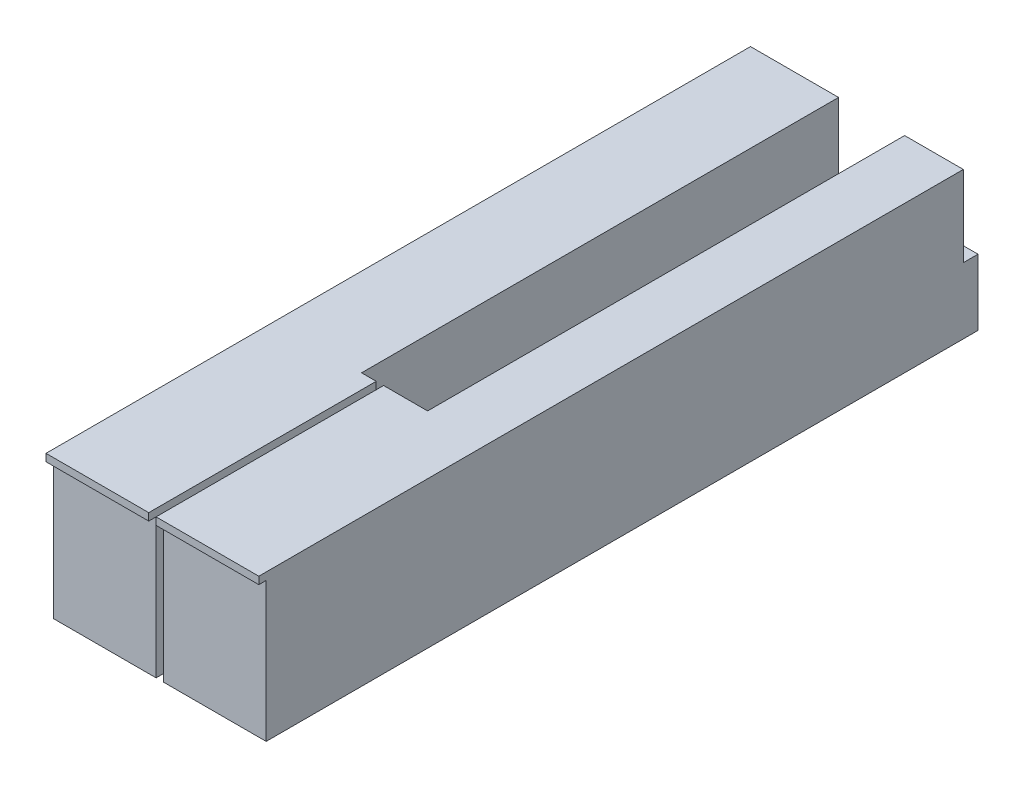
ISO-10303-21;
HEADER;
FILE_DESCRIPTION(('STEP AP214'),'2;1');
FILE_NAME('part.step','',(''),(''),'','','');
FILE_SCHEMA(('AUTOMOTIVE_DESIGN { 1 0 10303 214 1 1 1 1 }'));
ENDSEC;
DATA;
#1=APPLICATION_CONTEXT('core data for automotive mechanical design processes');
#2=APPLICATION_PROTOCOL_DEFINITION('international standard','automotive_design',2000,#1);
#3=PRODUCT_CONTEXT('',#1,'mechanical');
#4=PRODUCT('Part','Part','',(#3));
#5=PRODUCT_RELATED_PRODUCT_CATEGORY('part','',(#4));
#6=PRODUCT_DEFINITION_FORMATION('','',#4);
#7=PRODUCT_DEFINITION_CONTEXT('part definition',#1,'design');
#8=PRODUCT_DEFINITION('design','',#6,#7);
#9=PRODUCT_DEFINITION_SHAPE('','',#8);
#10=(LENGTH_UNIT() NAMED_UNIT(*) SI_UNIT(.MILLI.,.METRE.));
#11=(NAMED_UNIT(*) PLANE_ANGLE_UNIT() SI_UNIT($,.RADIAN.));
#12=(NAMED_UNIT(*) SI_UNIT($,.STERADIAN.) SOLID_ANGLE_UNIT());
#13=UNCERTAINTY_MEASURE_WITH_UNIT(LENGTH_MEASURE(1.E-05),#10,'distance_accuracy_value','');
#14=(GEOMETRIC_REPRESENTATION_CONTEXT(3) GLOBAL_UNCERTAINTY_ASSIGNED_CONTEXT((#13)) GLOBAL_UNIT_ASSIGNED_CONTEXT((#10,
#11,#12)) REPRESENTATION_CONTEXT('',''));
#15=CARTESIAN_POINT('',(0.,0.,0.));
#16=DIRECTION('',(0.,0.,1.));
#17=DIRECTION('',(1.,0.,0.));
#18=AXIS2_PLACEMENT_3D('',#15,#16,#17);
#19=CARTESIAN_POINT('',(-60.6735268259525,0.,-152.4));
#20=DIRECTION('',(0.,0.,1.));
#21=DIRECTION('',(1.,0.,0.));
#22=AXIS2_PLACEMENT_3D('',#19,#20,#21);
#23=PLANE('',#22);
#24=DIRECTION('',(1.,0.,0.));
#25=VECTOR('',#24,1.);
#26=CARTESIAN_POINT('',(-60.6735268259525,14.2875,-152.4));
#27=LINE('',#26,#25);
#28=CARTESIAN_POINT('',(-26.9875,14.2875,-152.4));
#29=VERTEX_POINT('',#28);
#30=CARTESIAN_POINT('',(-12.7,14.2875,-152.4));
#31=VERTEX_POINT('',#30);
#32=EDGE_CURVE('E51',#29,#31,#27,.T.);
#33=ORIENTED_EDGE('',*,*,#32,.F.);
#34=DIRECTION('',(0.,-1.,0.));
#35=VECTOR('',#34,1.);
#36=CARTESIAN_POINT('',(-26.9875,31.75,-152.4));
#37=LINE('',#36,#35);
#38=CARTESIAN_POINT('',(-26.9875,0.,-152.4));
#39=VERTEX_POINT('',#38);
#40=EDGE_CURVE('E251',#29,#39,#37,.T.);
#41=ORIENTED_EDGE('',*,*,#40,.T.);
#42=DIRECTION('',(1.,0.,0.));
#43=VECTOR('',#42,1.);
#44=CARTESIAN_POINT('',(-60.6735268259525,0.,-152.4));
#45=LINE('',#44,#43);
#46=CARTESIAN_POINT('',(-12.7,0.,-152.4));
#47=VERTEX_POINT('',#46);
#48=EDGE_CURVE('E277',#39,#47,#45,.T.);
#49=ORIENTED_EDGE('',*,*,#48,.T.);
#50=DIRECTION('',(0.,-1.,0.));
#51=VECTOR('',#50,1.);
#52=CARTESIAN_POINT('',(-12.7,31.75,-152.4));
#53=LINE('',#52,#51);
#54=EDGE_CURVE('E351',#31,#47,#53,.T.);
#55=ORIENTED_EDGE('',*,*,#54,.F.);
#56=EDGE_LOOP('',(#33,#41,#49,#55));
#57=FACE_BOUND('',#56,.T.);
#58=ADVANCED_FACE('F39',(#57),#23,.T.);
#59=CARTESIAN_POINT('',(0.,31.75,-152.4));
#60=DIRECTION('',(0.,0.,1.));
#61=DIRECTION('',(1.,0.,0.));
#62=AXIS2_PLACEMENT_3D('',#59,#60,#61);
#63=PLANE('',#62);
#64=CARTESIAN_POINT('',(0.,14.2875,-152.4));
#65=VERTEX_POINT('',#64);
#66=EDGE_CURVE('E11',#31,#65,#27,.T.);
#67=ORIENTED_EDGE('',*,*,#66,.F.);
#68=CARTESIAN_POINT('',(-12.7,31.75,-152.4));
#69=VERTEX_POINT('',#68);
#70=EDGE_CURVE('E352',#69,#31,#53,.T.);
#71=ORIENTED_EDGE('',*,*,#70,.F.);
#72=DIRECTION('',(-1.,0.,0.));
#73=VECTOR('',#72,1.);
#74=CARTESIAN_POINT('',(0.,31.75,-152.4));
#75=LINE('',#74,#73);
#76=CARTESIAN_POINT('',(0.,31.75,-152.4));
#77=VERTEX_POINT('',#76);
#78=EDGE_CURVE('E316',#77,#69,#75,.T.);
#79=ORIENTED_EDGE('',*,*,#78,.F.);
#80=DIRECTION('',(0.,-1.,0.));
#81=VECTOR('',#80,1.);
#82=CARTESIAN_POINT('',(0.,31.75,-152.4));
#83=LINE('',#82,#81);
#84=EDGE_CURVE('E356',#77,#65,#83,.T.);
#85=ORIENTED_EDGE('',*,*,#84,.T.);
#86=EDGE_LOOP('',(#67,#71,#79,#85));
#87=FACE_BOUND('',#86,.T.);
#88=ADVANCED_FACE('F427',(#87),#63,.F.);
#89=CARTESIAN_POINT('',(-22.225,31.75,0.));
#90=DIRECTION('',(0.,0.,-1.));
#91=DIRECTION('',(-1.,0.,0.));
#92=AXIS2_PLACEMENT_3D('',#89,#90,#91);
#93=PLANE('',#92);
#94=DIRECTION('',(0.,-1.,0.));
#95=VECTOR('',#94,1.);
#96=CARTESIAN_POINT('',(-22.225,31.75,0.));
#97=LINE('',#96,#95);
#98=CARTESIAN_POINT('',(-22.225,31.75,0.));
#99=VERTEX_POINT('',#98);
#100=CARTESIAN_POINT('',(-22.225,30.1625,0.));
#101=VERTEX_POINT('',#100);
#102=EDGE_CURVE('E328',#99,#101,#97,.T.);
#103=ORIENTED_EDGE('',*,*,#102,.T.);
#104=DIRECTION('',(1.,0.,0.));
#105=VECTOR('',#104,1.);
#106=CARTESIAN_POINT('',(-46.0375,30.1625,0.));
#107=LINE('',#106,#105);
#108=CARTESIAN_POINT('',(0.,30.1625,0.));
#109=VERTEX_POINT('',#108);
#110=EDGE_CURVE('E299',#101,#109,#107,.T.);
#111=ORIENTED_EDGE('',*,*,#110,.T.);
#112=DIRECTION('',(0.,-1.,0.));
#113=VECTOR('',#112,1.);
#114=CARTESIAN_POINT('',(0.,31.75,0.));
#115=LINE('',#114,#113);
#116=CARTESIAN_POINT('',(0.,31.75,0.));
#117=VERTEX_POINT('',#116);
#118=EDGE_CURVE('E359',#117,#109,#115,.T.);
#119=ORIENTED_EDGE('',*,*,#118,.F.);
#120=DIRECTION('',(1.,0.,0.));
#121=VECTOR('',#120,1.);
#122=CARTESIAN_POINT('',(-22.225,31.75,0.));
#123=LINE('',#122,#121);
#124=EDGE_CURVE('E308',#99,#117,#123,.T.);
#125=ORIENTED_EDGE('',*,*,#124,.F.);
#126=EDGE_LOOP('',(#103,#111,#119,#125));
#127=FACE_BOUND('',#126,.T.);
#128=ADVANCED_FACE('F41',(#127),#93,.F.);
#129=CARTESIAN_POINT('',(0.,31.75,0.));
#130=DIRECTION('',(-1.,0.,0.));
#131=DIRECTION('',(0.,0.,1.));
#132=AXIS2_PLACEMENT_3D('',#129,#130,#131);
#133=PLANE('',#132);
#134=ORIENTED_EDGE('',*,*,#118,.T.);
#135=DIRECTION('',(0.,0.,1.));
#136=VECTOR('',#135,1.);
#137=CARTESIAN_POINT('',(0.,30.1625,0.));
#138=LINE('',#137,#136);
#139=CARTESIAN_POINT('',(0.,30.1625,-1.5875));
#140=VERTEX_POINT('',#139);
#141=EDGE_CURVE('E295',#140,#109,#138,.T.);
#142=ORIENTED_EDGE('',*,*,#141,.F.);
#143=DIRECTION('',(0.,1.,0.));
#144=VECTOR('',#143,1.);
#145=CARTESIAN_POINT('',(0.,0.,-1.5875));
#146=LINE('',#145,#144);
#147=CARTESIAN_POINT('',(0.,0.,-1.5875));
#148=VERTEX_POINT('',#147);
#149=EDGE_CURVE('E291',#148,#140,#146,.T.);
#150=ORIENTED_EDGE('',*,*,#149,.F.);
#151=DIRECTION('',(0.,0.,-1.));
#152=VECTOR('',#151,1.);
#153=CARTESIAN_POINT('',(0.,0.,0.));
#154=LINE('',#153,#152);
#155=CARTESIAN_POINT('',(0.,0.,-155.575));
#156=VERTEX_POINT('',#155);
#157=EDGE_CURVE('E307',#148,#156,#154,.T.);
#158=ORIENTED_EDGE('',*,*,#157,.T.);
#159=DIRECTION('',(0.,1.,0.));
#160=VECTOR('',#159,1.);
#161=CARTESIAN_POINT('',(0.,0.,-155.575));
#162=LINE('',#161,#160);
#163=CARTESIAN_POINT('',(0.,14.2875,-155.575));
#164=VERTEX_POINT('',#163);
#165=EDGE_CURVE('E264',#156,#164,#162,.T.);
#166=ORIENTED_EDGE('',*,*,#165,.T.);
#167=DIRECTION('',(0.,0.,1.));
#168=VECTOR('',#167,1.);
#169=CARTESIAN_POINT('',(0.,14.2875,-152.4));
#170=LINE('',#169,#168);
#171=EDGE_CURVE('E274',#164,#65,#170,.T.);
#172=ORIENTED_EDGE('',*,*,#171,.T.);
#173=ORIENTED_EDGE('',*,*,#84,.F.);
#174=DIRECTION('',(0.,0.,-1.));
#175=VECTOR('',#174,1.);
#176=CARTESIAN_POINT('',(0.,31.75,0.));
#177=LINE('',#176,#175);
#178=EDGE_CURVE('E312',#117,#77,#177,.T.);
#179=ORIENTED_EDGE('',*,*,#178,.F.);
#180=EDGE_LOOP('',(#134,#142,#150,#158,#166,#172,#173,#179));
#181=FACE_BOUND('',#180,.T.);
#182=ADVANCED_FACE('F422',(#181),#133,.F.);
#183=CARTESIAN_POINT('',(-12.7,31.75,-152.4));
#184=DIRECTION('',(1.,0.,0.));
#185=DIRECTION('',(0.,0.,-1.));
#186=AXIS2_PLACEMENT_3D('',#183,#184,#185);
#187=PLANE('',#186);
#188=DIRECTION('',(0.,0.,1.));
#189=VECTOR('',#188,1.);
#190=CARTESIAN_POINT('',(-12.7,0.,-152.4));
#191=LINE('',#190,#189);
#192=CARTESIAN_POINT('',(-12.7,0.,-49.2125));
#193=VERTEX_POINT('',#192);
#194=EDGE_CURVE('E331',#47,#193,#191,.T.);
#195=ORIENTED_EDGE('',*,*,#194,.T.);
#196=DIRECTION('',(0.,-1.,0.));
#197=VECTOR('',#196,1.);
#198=CARTESIAN_POINT('',(-12.7,31.75,-49.2125));
#199=LINE('',#198,#197);
#200=CARTESIAN_POINT('',(-12.7,31.75,-49.2125));
#201=VERTEX_POINT('',#200);
#202=EDGE_CURVE('E347',#201,#193,#199,.T.);
#203=ORIENTED_EDGE('',*,*,#202,.F.);
#204=DIRECTION('',(0.,0.,1.));
#205=VECTOR('',#204,1.);
#206=CARTESIAN_POINT('',(-12.7,31.75,-152.4));
#207=LINE('',#206,#205);
#208=EDGE_CURVE('E319',#69,#201,#207,.T.);
#209=ORIENTED_EDGE('',*,*,#208,.F.);
#210=ORIENTED_EDGE('',*,*,#70,.T.);
#211=ORIENTED_EDGE('',*,*,#54,.T.);
#212=EDGE_LOOP('',(#195,#203,#209,#210,#211));
#213=FACE_BOUND('',#212,.T.);
#214=ADVANCED_FACE('F391',(#213),#187,.F.);
#215=CARTESIAN_POINT('',(-12.7,31.75,-49.2125));
#216=DIRECTION('',(0.,0.,1.));
#217=DIRECTION('',(1.,0.,0.));
#218=AXIS2_PLACEMENT_3D('',#215,#216,#217);
#219=PLANE('',#218);
#220=DIRECTION('',(-1.,0.,0.));
#221=VECTOR('',#220,1.);
#222=CARTESIAN_POINT('',(-12.7,0.,-49.2125));
#223=LINE('',#222,#221);
#224=CARTESIAN_POINT('',(-22.225,0.,-49.2125));
#225=VERTEX_POINT('',#224);
#226=EDGE_CURVE('E334',#193,#225,#223,.T.);
#227=ORIENTED_EDGE('',*,*,#226,.T.);
#228=DIRECTION('',(0.,-1.,0.));
#229=VECTOR('',#228,1.);
#230=CARTESIAN_POINT('',(-22.225,31.75,-49.2125));
#231=LINE('',#230,#229);
#232=CARTESIAN_POINT('',(-22.225,31.75,-49.2125));
#233=VERTEX_POINT('',#232);
#234=EDGE_CURVE('E343',#233,#225,#231,.T.);
#235=ORIENTED_EDGE('',*,*,#234,.F.);
#236=DIRECTION('',(-1.,0.,0.));
#237=VECTOR('',#236,1.);
#238=CARTESIAN_POINT('',(-12.7,31.75,-49.2125));
#239=LINE('',#238,#237);
#240=EDGE_CURVE('E322',#201,#233,#239,.T.);
#241=ORIENTED_EDGE('',*,*,#240,.F.);
#242=ORIENTED_EDGE('',*,*,#202,.T.);
#243=EDGE_LOOP('',(#227,#235,#241,#242));
#244=FACE_BOUND('',#243,.T.);
#245=ADVANCED_FACE('F387',(#244),#219,.F.);
#246=CARTESIAN_POINT('',(-22.225,31.75,-49.2125));
#247=DIRECTION('',(1.,0.,0.));
#248=DIRECTION('',(0.,0.,-1.));
#249=AXIS2_PLACEMENT_3D('',#246,#247,#248);
#250=PLANE('',#249);
#251=DIRECTION('',(0.,1.,0.));
#252=VECTOR('',#251,1.);
#253=CARTESIAN_POINT('',(-22.225,31.75,-1.5875));
#254=LINE('',#253,#252);
#255=CARTESIAN_POINT('',(-22.225,0.,-1.5875));
#256=VERTEX_POINT('',#255);
#257=CARTESIAN_POINT('',(-22.225,30.1625,-1.5875));
#258=VERTEX_POINT('',#257);
#259=EDGE_CURVE('E64',#256,#258,#254,.T.);
#260=ORIENTED_EDGE('',*,*,#259,.T.);
#261=DIRECTION('',(0.,0.,1.));
#262=VECTOR('',#261,1.);
#263=CARTESIAN_POINT('',(-22.225,30.1625,-49.2125));
#264=LINE('',#263,#262);
#265=EDGE_CURVE('E43',#258,#101,#264,.T.);
#266=ORIENTED_EDGE('',*,*,#265,.T.);
#267=ORIENTED_EDGE('',*,*,#102,.F.);
#268=DIRECTION('',(0.,0.,1.));
#269=VECTOR('',#268,1.);
#270=CARTESIAN_POINT('',(-22.225,31.75,-49.2125));
#271=LINE('',#270,#269);
#272=EDGE_CURVE('E325',#233,#99,#271,.T.);
#273=ORIENTED_EDGE('',*,*,#272,.F.);
#274=ORIENTED_EDGE('',*,*,#234,.T.);
#275=DIRECTION('',(0.,0.,1.));
#276=VECTOR('',#275,1.);
#277=CARTESIAN_POINT('',(-22.225,0.,-49.2125));
#278=LINE('',#277,#276);
#279=EDGE_CURVE('E313',#225,#256,#278,.T.);
#280=ORIENTED_EDGE('',*,*,#279,.T.);
#281=EDGE_LOOP('',(#260,#266,#267,#273,#274,#280));
#282=FACE_BOUND('',#281,.T.);
#283=ADVANCED_FACE('F371',(#282),#250,.F.);
#284=CARTESIAN_POINT('',(0.,31.75,0.));
#285=DIRECTION('',(0.,1.,0.));
#286=DIRECTION('',(0.,0.,1.));
#287=AXIS2_PLACEMENT_3D('',#284,#285,#286);
#288=PLANE('',#287);
#289=ORIENTED_EDGE('',*,*,#124,.T.);
#290=ORIENTED_EDGE('',*,*,#178,.T.);
#291=ORIENTED_EDGE('',*,*,#78,.T.);
#292=ORIENTED_EDGE('',*,*,#208,.T.);
#293=ORIENTED_EDGE('',*,*,#240,.T.);
#294=ORIENTED_EDGE('',*,*,#272,.T.);
#295=EDGE_LOOP('',(#289,#290,#291,#292,#293,#294));
#296=FACE_BOUND('',#295,.T.);
#297=ADVANCED_FACE('F378',(#296),#288,.T.);
#298=CARTESIAN_POINT('',(0.,0.,0.));
#299=DIRECTION('',(0.,1.,0.));
#300=DIRECTION('',(0.,0.,1.));
#301=AXIS2_PLACEMENT_3D('',#298,#299,#300);
#302=PLANE('',#301);
#303=ORIENTED_EDGE('',*,*,#157,.F.);
#304=DIRECTION('',(-1.,0.,0.));
#305=VECTOR('',#304,1.);
#306=CARTESIAN_POINT('',(0.,0.,-1.5875));
#307=LINE('',#306,#305);
#308=EDGE_CURVE('E362',#148,#256,#307,.T.);
#309=ORIENTED_EDGE('',*,*,#308,.T.);
#310=ORIENTED_EDGE('',*,*,#279,.F.);
#311=ORIENTED_EDGE('',*,*,#226,.F.);
#312=ORIENTED_EDGE('',*,*,#194,.F.);
#313=ORIENTED_EDGE('',*,*,#48,.F.);
#314=DIRECTION('',(0.,0.,-1.));
#315=VECTOR('',#314,1.);
#316=CARTESIAN_POINT('',(-26.9875,0.,-152.4));
#317=LINE('',#316,#315);
#318=CARTESIAN_POINT('',(-26.9875,0.,-49.2125));
#319=VERTEX_POINT('',#318);
#320=EDGE_CURVE('E219',#319,#39,#317,.T.);
#321=ORIENTED_EDGE('',*,*,#320,.F.);
#322=DIRECTION('',(-1.,0.,0.));
#323=VECTOR('',#322,1.);
#324=CARTESIAN_POINT('',(-26.9875,0.,-49.2125));
#325=LINE('',#324,#323);
#326=CARTESIAN_POINT('',(-23.8125,0.,-49.2125));
#327=VERTEX_POINT('',#326);
#328=EDGE_CURVE('E237',#327,#319,#325,.T.);
#329=ORIENTED_EDGE('',*,*,#328,.F.);
#330=DIRECTION('',(0.,0.,-1.));
#331=VECTOR('',#330,1.);
#332=CARTESIAN_POINT('',(-23.8125,0.,-49.2125));
#333=LINE('',#332,#331);
#334=CARTESIAN_POINT('',(-23.8125,0.,-1.5875));
#335=VERTEX_POINT('',#334);
#336=EDGE_CURVE('E213',#335,#327,#333,.T.);
#337=ORIENTED_EDGE('',*,*,#336,.F.);
#338=DIRECTION('',(1.,0.,0.));
#339=VECTOR('',#338,1.);
#340=CARTESIAN_POINT('',(-46.0375,0.,-1.5875));
#341=LINE('',#340,#339);
#342=CARTESIAN_POINT('',(-46.0375,0.,-1.5875));
#343=VERTEX_POINT('',#342);
#344=EDGE_CURVE('E187',#343,#335,#341,.T.);
#345=ORIENTED_EDGE('',*,*,#344,.F.);
#346=DIRECTION('',(0.,0.,1.));
#347=VECTOR('',#346,1.);
#348=CARTESIAN_POINT('',(-46.0375,0.,-152.4));
#349=LINE('',#348,#347);
#350=CARTESIAN_POINT('',(-46.0375,0.,-155.575));
#351=VERTEX_POINT('',#350);
#352=EDGE_CURVE('E200',#351,#343,#349,.T.);
#353=ORIENTED_EDGE('',*,*,#352,.F.);
#354=DIRECTION('',(1.,0.,0.));
#355=VECTOR('',#354,1.);
#356=CARTESIAN_POINT('',(-60.6735268259525,0.,-155.575));
#357=LINE('',#356,#355);
#358=EDGE_CURVE('E283',#351,#156,#357,.T.);
#359=ORIENTED_EDGE('',*,*,#358,.T.);
#360=EDGE_LOOP('',(#303,#309,#310,#311,#312,#313,#321,#329,#337,#345,#353,#359));
#361=FACE_BOUND('',#360,.T.);
#362=ADVANCED_FACE('F384',(#361),#302,.F.);
#363=CARTESIAN_POINT('',(-46.0375,30.1625,0.));
#364=DIRECTION('',(0.,1.,0.));
#365=DIRECTION('',(0.,0.,1.));
#366=AXIS2_PLACEMENT_3D('',#363,#364,#365);
#367=PLANE('',#366);
#368=DIRECTION('',(1.,0.,0.));
#369=VECTOR('',#368,1.);
#370=CARTESIAN_POINT('',(-46.0375,30.1625,-1.5875));
#371=LINE('',#370,#369);
#372=EDGE_CURVE('E298',#258,#140,#371,.T.);
#373=ORIENTED_EDGE('',*,*,#372,.T.);
#374=ORIENTED_EDGE('',*,*,#141,.T.);
#375=ORIENTED_EDGE('',*,*,#110,.F.);
#376=ORIENTED_EDGE('',*,*,#265,.F.);
#377=EDGE_LOOP('',(#373,#374,#375,#376));
#378=FACE_BOUND('',#377,.T.);
#379=ADVANCED_FACE('F430',(#378),#367,.F.);
#380=CARTESIAN_POINT('',(-46.0375,0.,-1.5875));
#381=DIRECTION('',(0.,0.,-1.));
#382=DIRECTION('',(-1.,0.,0.));
#383=AXIS2_PLACEMENT_3D('',#380,#381,#382);
#384=PLANE('',#383);
#385=ORIENTED_EDGE('',*,*,#308,.F.);
#386=ORIENTED_EDGE('',*,*,#149,.T.);
#387=ORIENTED_EDGE('',*,*,#372,.F.);
#388=ORIENTED_EDGE('',*,*,#259,.F.);
#389=EDGE_LOOP('',(#385,#386,#387,#388));
#390=FACE_BOUND('',#389,.T.);
#391=ADVANCED_FACE('F431',(#390),#384,.F.);
#392=CARTESIAN_POINT('',(-60.6735268259525,14.2875,-152.4));
#393=DIRECTION('',(0.,1.,0.));
#394=DIRECTION('',(0.,0.,1.));
#395=AXIS2_PLACEMENT_3D('',#392,#393,#394);
#396=PLANE('',#395);
#397=DIRECTION('',(0.,0.,-1.));
#398=VECTOR('',#397,1.);
#399=CARTESIAN_POINT('',(-46.0375,14.2875,-152.4));
#400=LINE('',#399,#398);
#401=CARTESIAN_POINT('',(-46.0375,14.2875,-152.4));
#402=VERTEX_POINT('',#401);
#403=CARTESIAN_POINT('',(-46.0375,14.2875,-155.575));
#404=VERTEX_POINT('',#403);
#405=EDGE_CURVE('E268',#402,#404,#400,.T.);
#406=ORIENTED_EDGE('',*,*,#405,.F.);
#407=EDGE_CURVE('E50',#402,#29,#27,.T.);
#408=ORIENTED_EDGE('',*,*,#407,.T.);
#409=ORIENTED_EDGE('',*,*,#32,.T.);
#410=ORIENTED_EDGE('',*,*,#66,.T.);
#411=ORIENTED_EDGE('',*,*,#171,.F.);
#412=DIRECTION('',(1.,0.,0.));
#413=VECTOR('',#412,1.);
#414=CARTESIAN_POINT('',(-60.6735268259525,14.2875,-155.575));
#415=LINE('',#414,#413);
#416=EDGE_CURVE('E280',#404,#164,#415,.T.);
#417=ORIENTED_EDGE('',*,*,#416,.F.);
#418=EDGE_LOOP('',(#406,#408,#409,#410,#411,#417));
#419=FACE_BOUND('',#418,.T.);
#420=ADVANCED_FACE('F425',(#419),#396,.T.);
#421=CARTESIAN_POINT('',(-60.6735268259525,0.,-155.575));
#422=DIRECTION('',(0.,0.,-1.));
#423=DIRECTION('',(-1.,0.,0.));
#424=AXIS2_PLACEMENT_3D('',#421,#422,#423);
#425=PLANE('',#424);
#426=DIRECTION('',(0.,-1.,0.));
#427=VECTOR('',#426,1.);
#428=CARTESIAN_POINT('',(-46.0375,0.,-155.575));
#429=LINE('',#428,#427);
#430=EDGE_CURVE('E265',#404,#351,#429,.T.);
#431=ORIENTED_EDGE('',*,*,#430,.F.);
#432=ORIENTED_EDGE('',*,*,#416,.T.);
#433=ORIENTED_EDGE('',*,*,#165,.F.);
#434=ORIENTED_EDGE('',*,*,#358,.F.);
#435=EDGE_LOOP('',(#431,#432,#433,#434));
#436=FACE_BOUND('',#435,.T.);
#437=ADVANCED_FACE('F418',(#436),#425,.T.);
#438=CARTESIAN_POINT('',(-46.0375,31.75,0.));
#439=DIRECTION('',(1.,0.,0.));
#440=DIRECTION('',(0.,0.,-1.));
#441=AXIS2_PLACEMENT_3D('',#438,#439,#440);
#442=PLANE('',#441);
#443=ORIENTED_EDGE('',*,*,#352,.T.);
#444=DIRECTION('',(0.,1.,0.));
#445=VECTOR('',#444,1.);
#446=CARTESIAN_POINT('',(-46.0375,0.,-1.5875));
#447=LINE('',#446,#445);
#448=CARTESIAN_POINT('',(-46.0375,30.1625,-1.5875));
#449=VERTEX_POINT('',#448);
#450=EDGE_CURVE('E179',#343,#449,#447,.T.);
#451=ORIENTED_EDGE('',*,*,#450,.T.);
#452=DIRECTION('',(0.,0.,1.));
#453=VECTOR('',#452,1.);
#454=CARTESIAN_POINT('',(-46.0375,30.1625,0.));
#455=LINE('',#454,#453);
#456=CARTESIAN_POINT('',(-46.0375,30.1625,0.));
#457=VERTEX_POINT('',#456);
#458=EDGE_CURVE('E190',#449,#457,#455,.T.);
#459=ORIENTED_EDGE('',*,*,#458,.T.);
#460=DIRECTION('',(0.,-1.,0.));
#461=VECTOR('',#460,1.);
#462=CARTESIAN_POINT('',(-46.0375,31.75,0.));
#463=LINE('',#462,#461);
#464=CARTESIAN_POINT('',(-46.0375,31.75,0.));
#465=VERTEX_POINT('',#464);
#466=EDGE_CURVE('E245',#465,#457,#463,.T.);
#467=ORIENTED_EDGE('',*,*,#466,.F.);
#468=DIRECTION('',(0.,0.,1.));
#469=VECTOR('',#468,1.);
#470=CARTESIAN_POINT('',(-46.0375,31.75,0.));
#471=LINE('',#470,#469);
#472=CARTESIAN_POINT('',(-46.0375,31.75,-152.4));
#473=VERTEX_POINT('',#472);
#474=EDGE_CURVE('E228',#473,#465,#471,.T.);
#475=ORIENTED_EDGE('',*,*,#474,.F.);
#476=DIRECTION('',(0.,-1.,0.));
#477=VECTOR('',#476,1.);
#478=CARTESIAN_POINT('',(-46.0375,31.75,-152.4));
#479=LINE('',#478,#477);
#480=EDGE_CURVE('E248',#473,#402,#479,.T.);
#481=ORIENTED_EDGE('',*,*,#480,.T.);
#482=ORIENTED_EDGE('',*,*,#405,.T.);
#483=ORIENTED_EDGE('',*,*,#430,.T.);
#484=EDGE_LOOP('',(#443,#451,#459,#467,#475,#481,#482,#483));
#485=FACE_BOUND('',#484,.T.);
#486=ADVANCED_FACE('F198',(#485),#442,.F.);
#487=CARTESIAN_POINT('',(-23.8125,31.75,-49.2125));
#488=DIRECTION('',(-1.,0.,0.));
#489=DIRECTION('',(0.,0.,1.));
#490=AXIS2_PLACEMENT_3D('',#487,#488,#489);
#491=PLANE('',#490);
#492=DIRECTION('',(0.,-1.,0.));
#493=VECTOR('',#492,1.);
#494=CARTESIAN_POINT('',(-23.8125,31.75,0.));
#495=LINE('',#494,#493);
#496=CARTESIAN_POINT('',(-23.8125,31.75,0.));
#497=VERTEX_POINT('',#496);
#498=CARTESIAN_POINT('',(-23.8125,30.1625,0.));
#499=VERTEX_POINT('',#498);
#500=EDGE_CURVE('E234',#497,#499,#495,.T.);
#501=ORIENTED_EDGE('',*,*,#500,.T.);
#502=DIRECTION('',(0.,0.,-1.));
#503=VECTOR('',#502,1.);
#504=CARTESIAN_POINT('',(-23.8125,30.1625,-49.2125));
#505=LINE('',#504,#503);
#506=CARTESIAN_POINT('',(-23.8125,30.1625,-1.5875));
#507=VERTEX_POINT('',#506);
#508=EDGE_CURVE('E210',#499,#507,#505,.T.);
#509=ORIENTED_EDGE('',*,*,#508,.T.);
#510=DIRECTION('',(0.,-1.,0.));
#511=VECTOR('',#510,1.);
#512=CARTESIAN_POINT('',(-23.8125,31.75,-1.5875));
#513=LINE('',#512,#511);
#514=EDGE_CURVE('E182',#507,#335,#513,.T.);
#515=ORIENTED_EDGE('',*,*,#514,.T.);
#516=ORIENTED_EDGE('',*,*,#336,.T.);
#517=DIRECTION('',(0.,-1.,0.));
#518=VECTOR('',#517,1.);
#519=CARTESIAN_POINT('',(-23.8125,31.75,-49.2125));
#520=LINE('',#519,#518);
#521=CARTESIAN_POINT('',(-23.8125,31.75,-49.2125));
#522=VERTEX_POINT('',#521);
#523=EDGE_CURVE('E260',#522,#327,#520,.T.);
#524=ORIENTED_EDGE('',*,*,#523,.F.);
#525=DIRECTION('',(0.,0.,-1.));
#526=VECTOR('',#525,1.);
#527=CARTESIAN_POINT('',(-23.8125,31.75,-49.2125));
#528=LINE('',#527,#526);
#529=EDGE_CURVE('E214',#497,#522,#528,.T.);
#530=ORIENTED_EDGE('',*,*,#529,.F.);
#531=EDGE_LOOP('',(#501,#509,#515,#516,#524,#530));
#532=FACE_BOUND('',#531,.T.);
#533=ADVANCED_FACE('F413',(#532),#491,.F.);
#534=CARTESIAN_POINT('',(-26.9875,31.75,-49.2125));
#535=DIRECTION('',(0.,0.,1.));
#536=DIRECTION('',(1.,0.,0.));
#537=AXIS2_PLACEMENT_3D('',#534,#535,#536);
#538=PLANE('',#537);
#539=ORIENTED_EDGE('',*,*,#328,.T.);
#540=DIRECTION('',(0.,-1.,0.));
#541=VECTOR('',#540,1.);
#542=CARTESIAN_POINT('',(-26.9875,31.75,-49.2125));
#543=LINE('',#542,#541);
#544=CARTESIAN_POINT('',(-26.9875,31.75,-49.2125));
#545=VERTEX_POINT('',#544);
#546=EDGE_CURVE('E256',#545,#319,#543,.T.);
#547=ORIENTED_EDGE('',*,*,#546,.F.);
#548=DIRECTION('',(-1.,0.,0.));
#549=VECTOR('',#548,1.);
#550=CARTESIAN_POINT('',(-26.9875,31.75,-49.2125));
#551=LINE('',#550,#549);
#552=EDGE_CURVE('E218',#522,#545,#551,.T.);
#553=ORIENTED_EDGE('',*,*,#552,.F.);
#554=ORIENTED_EDGE('',*,*,#523,.T.);
#555=EDGE_LOOP('',(#539,#547,#553,#554));
#556=FACE_BOUND('',#555,.T.);
#557=ADVANCED_FACE('F409',(#556),#538,.F.);
#558=CARTESIAN_POINT('',(-26.9875,31.75,-152.4));
#559=DIRECTION('',(-1.,0.,0.));
#560=DIRECTION('',(0.,0.,1.));
#561=AXIS2_PLACEMENT_3D('',#558,#559,#560);
#562=PLANE('',#561);
#563=ORIENTED_EDGE('',*,*,#320,.T.);
#564=ORIENTED_EDGE('',*,*,#40,.F.);
#565=CARTESIAN_POINT('',(-26.9875,31.75,-152.4));
#566=VERTEX_POINT('',#565);
#567=EDGE_CURVE('E252',#566,#29,#37,.T.);
#568=ORIENTED_EDGE('',*,*,#567,.F.);
#569=DIRECTION('',(0.,0.,-1.));
#570=VECTOR('',#569,1.);
#571=CARTESIAN_POINT('',(-26.9875,31.75,-152.4));
#572=LINE('',#571,#570);
#573=EDGE_CURVE('E222',#545,#566,#572,.T.);
#574=ORIENTED_EDGE('',*,*,#573,.F.);
#575=ORIENTED_EDGE('',*,*,#546,.T.);
#576=EDGE_LOOP('',(#563,#564,#568,#574,#575));
#577=FACE_BOUND('',#576,.T.);
#578=ADVANCED_FACE('F405',(#577),#562,.F.);
#579=CARTESIAN_POINT('',(-46.0375,31.75,-152.4));
#580=DIRECTION('',(0.,0.,1.));
#581=DIRECTION('',(1.,0.,0.));
#582=AXIS2_PLACEMENT_3D('',#579,#580,#581);
#583=PLANE('',#582);
#584=ORIENTED_EDGE('',*,*,#407,.F.);
#585=ORIENTED_EDGE('',*,*,#480,.F.);
#586=DIRECTION('',(-1.,0.,0.));
#587=VECTOR('',#586,1.);
#588=CARTESIAN_POINT('',(-46.0375,31.75,-152.4));
#589=LINE('',#588,#587);
#590=EDGE_CURVE('E225',#566,#473,#589,.T.);
#591=ORIENTED_EDGE('',*,*,#590,.F.);
#592=ORIENTED_EDGE('',*,*,#567,.T.);
#593=EDGE_LOOP('',(#584,#585,#591,#592));
#594=FACE_BOUND('',#593,.T.);
#595=ADVANCED_FACE('F458',(#594),#583,.F.);
#596=CARTESIAN_POINT('',(-23.8125,31.75,0.));
#597=DIRECTION('',(0.,0.,-1.));
#598=DIRECTION('',(-1.,0.,0.));
#599=AXIS2_PLACEMENT_3D('',#596,#597,#598);
#600=PLANE('',#599);
#601=ORIENTED_EDGE('',*,*,#466,.T.);
#602=DIRECTION('',(1.,0.,0.));
#603=VECTOR('',#602,1.);
#604=CARTESIAN_POINT('',(-46.0375,30.1625,0.));
#605=LINE('',#604,#603);
#606=EDGE_CURVE('E186',#457,#499,#605,.T.);
#607=ORIENTED_EDGE('',*,*,#606,.T.);
#608=ORIENTED_EDGE('',*,*,#500,.F.);
#609=DIRECTION('',(1.,0.,0.));
#610=VECTOR('',#609,1.);
#611=CARTESIAN_POINT('',(-23.8125,31.75,0.));
#612=LINE('',#611,#610);
#613=EDGE_CURVE('E231',#465,#497,#612,.T.);
#614=ORIENTED_EDGE('',*,*,#613,.F.);
#615=EDGE_LOOP('',(#601,#607,#608,#614));
#616=FACE_BOUND('',#615,.T.);
#617=ADVANCED_FACE('F461',(#616),#600,.F.);
#618=CARTESIAN_POINT('',(0.,31.75,0.));
#619=DIRECTION('',(0.,-1.,0.));
#620=DIRECTION('',(0.,0.,-1.));
#621=AXIS2_PLACEMENT_3D('',#618,#619,#620);
#622=PLANE('',#621);
#623=ORIENTED_EDGE('',*,*,#529,.T.);
#624=ORIENTED_EDGE('',*,*,#552,.T.);
#625=ORIENTED_EDGE('',*,*,#573,.T.);
#626=ORIENTED_EDGE('',*,*,#590,.T.);
#627=ORIENTED_EDGE('',*,*,#474,.T.);
#628=ORIENTED_EDGE('',*,*,#613,.T.);
#629=EDGE_LOOP('',(#623,#624,#625,#626,#627,#628));
#630=FACE_BOUND('',#629,.T.);
#631=ADVANCED_FACE('F465',(#630),#622,.F.);
#632=CARTESIAN_POINT('',(-46.0375,30.1625,0.));
#633=DIRECTION('',(0.,1.,0.));
#634=DIRECTION('',(0.,0.,1.));
#635=AXIS2_PLACEMENT_3D('',#632,#633,#634);
#636=PLANE('',#635);
#637=ORIENTED_EDGE('',*,*,#606,.F.);
#638=ORIENTED_EDGE('',*,*,#458,.F.);
#639=DIRECTION('',(1.,0.,0.));
#640=VECTOR('',#639,1.);
#641=CARTESIAN_POINT('',(-46.0375,30.1625,-1.5875));
#642=LINE('',#641,#640);
#643=EDGE_CURVE('E175',#449,#507,#642,.T.);
#644=ORIENTED_EDGE('',*,*,#643,.T.);
#645=ORIENTED_EDGE('',*,*,#508,.F.);
#646=EDGE_LOOP('',(#637,#638,#644,#645));
#647=FACE_BOUND('',#646,.T.);
#648=ADVANCED_FACE('F191',(#647),#636,.F.);
#649=CARTESIAN_POINT('',(-46.0375,0.,-1.5875));
#650=DIRECTION('',(0.,0.,-1.));
#651=DIRECTION('',(-1.,0.,0.));
#652=AXIS2_PLACEMENT_3D('',#649,#650,#651);
#653=PLANE('',#652);
#654=ORIENTED_EDGE('',*,*,#643,.F.);
#655=ORIENTED_EDGE('',*,*,#450,.F.);
#656=ORIENTED_EDGE('',*,*,#344,.T.);
#657=ORIENTED_EDGE('',*,*,#514,.F.);
#658=EDGE_LOOP('',(#654,#655,#656,#657));
#659=FACE_BOUND('',#658,.T.);
#660=ADVANCED_FACE('F177',(#659),#653,.F.);
#661=CLOSED_SHELL('',(#58,#88,#128,#182,#214,#245,#283,#297,#362,#379,#391,#420,#437,#486,#533,
#557,#578,#595,#617,#631,#648,#660));
#662=MANIFOLD_SOLID_BREP('B2',#661);
#663=ADVANCED_BREP_SHAPE_REPRESENTATION('',(#18,#662),#14);
#664=SHAPE_DEFINITION_REPRESENTATION(#9,#663);
ENDSEC;
END-ISO-10303-21;
